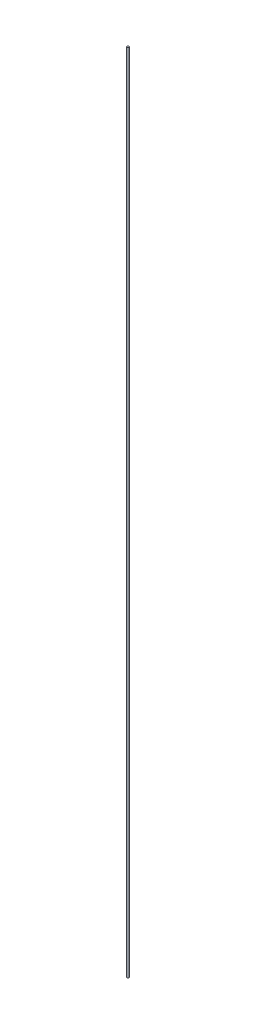
ISO-10303-21;
HEADER;
FILE_DESCRIPTION(('STEP AP214'),'2;1');
FILE_NAME('part.step','',(''),(''),'','','');
FILE_SCHEMA(('AUTOMOTIVE_DESIGN { 1 0 10303 214 1 1 1 1 }'));
ENDSEC;
DATA;
#1=APPLICATION_CONTEXT('core data for automotive mechanical design processes');
#2=APPLICATION_PROTOCOL_DEFINITION('international standard','automotive_design',2000,#1);
#3=PRODUCT_CONTEXT('',#1,'mechanical');
#4=PRODUCT('Part','Part','',(#3));
#5=PRODUCT_RELATED_PRODUCT_CATEGORY('part','',(#4));
#6=PRODUCT_DEFINITION_FORMATION('','',#4);
#7=PRODUCT_DEFINITION_CONTEXT('part definition',#1,'design');
#8=PRODUCT_DEFINITION('design','',#6,#7);
#9=PRODUCT_DEFINITION_SHAPE('','',#8);
#10=(LENGTH_UNIT() NAMED_UNIT(*) SI_UNIT(.MILLI.,.METRE.));
#11=(NAMED_UNIT(*) PLANE_ANGLE_UNIT() SI_UNIT($,.RADIAN.));
#12=(NAMED_UNIT(*) SI_UNIT($,.STERADIAN.) SOLID_ANGLE_UNIT());
#13=UNCERTAINTY_MEASURE_WITH_UNIT(LENGTH_MEASURE(1.E-05),#10,'distance_accuracy_value','');
#14=(GEOMETRIC_REPRESENTATION_CONTEXT(3) GLOBAL_UNCERTAINTY_ASSIGNED_CONTEXT((#13)) GLOBAL_UNIT_ASSIGNED_CONTEXT((#10,
#11,#12)) REPRESENTATION_CONTEXT('',''));
#15=CARTESIAN_POINT('',(0.,0.,0.));
#16=DIRECTION('',(0.,0.,1.));
#17=DIRECTION('',(1.,0.,0.));
#18=AXIS2_PLACEMENT_3D('',#15,#16,#17);
#19=CARTESIAN_POINT('',(0.,977.9,0.));
#20=DIRECTION('',(0.,-1.,0.));
#21=DIRECTION('',(0.,0.,-1.));
#22=AXIS2_PLACEMENT_3D('',#19,#20,#21);
#23=CYLINDRICAL_SURFACE('',#22,1.27);
#24=CARTESIAN_POINT('',(0.,977.9,0.));
#25=DIRECTION('',(0.,1.,0.));
#26=DIRECTION('',(0.,0.,1.));
#27=AXIS2_PLACEMENT_3D('',#24,#25,#26);
#28=CIRCLE('',#27,1.27);
#29=CARTESIAN_POINT('',(0.,977.9,1.27));
#30=VERTEX_POINT('',#29);
#31=EDGE_CURVE('E10',#30,#30,#28,.T.);
#32=ORIENTED_EDGE('',*,*,#31,.F.);
#33=EDGE_LOOP('',(#32));
#34=FACE_BOUND('',#33,.T.);
#35=CARTESIAN_POINT('',(0.,0.,0.));
#36=DIRECTION('',(0.,1.,0.));
#37=DIRECTION('',(0.,0.,1.));
#38=AXIS2_PLACEMENT_3D('',#35,#36,#37);
#39=CIRCLE('',#38,1.27);
#40=CARTESIAN_POINT('',(0.,0.,1.27));
#41=VERTEX_POINT('',#40);
#42=EDGE_CURVE('E34',#41,#41,#39,.T.);
#43=ORIENTED_EDGE('',*,*,#42,.T.);
#44=EDGE_LOOP('',(#43));
#45=FACE_BOUND('',#44,.T.);
#46=ADVANCED_FACE('F31',(#34,#45),#23,.T.);
#47=CARTESIAN_POINT('',(0.,977.9,0.));
#48=DIRECTION('',(0.,1.,0.));
#49=DIRECTION('',(0.,0.,1.));
#50=AXIS2_PLACEMENT_3D('',#47,#48,#49);
#51=PLANE('',#50);
#52=ORIENTED_EDGE('',*,*,#31,.T.);
#53=EDGE_LOOP('',(#52));
#54=FACE_BOUND('',#53,.T.);
#55=ADVANCED_FACE('F46',(#54),#51,.T.);
#56=CARTESIAN_POINT('',(0.,0.,0.));
#57=DIRECTION('',(0.,1.,0.));
#58=DIRECTION('',(0.,0.,1.));
#59=AXIS2_PLACEMENT_3D('',#56,#57,#58);
#60=PLANE('',#59);
#61=ORIENTED_EDGE('',*,*,#42,.F.);
#62=EDGE_LOOP('',(#61));
#63=FACE_BOUND('',#62,.T.);
#64=ADVANCED_FACE('F44',(#63),#60,.F.);
#65=CLOSED_SHELL('',(#46,#55,#64));
#66=MANIFOLD_SOLID_BREP('B2',#65);
#67=ADVANCED_BREP_SHAPE_REPRESENTATION('',(#18,#66),#14);
#68=SHAPE_DEFINITION_REPRESENTATION(#9,#67);
ENDSEC;
END-ISO-10303-21;
